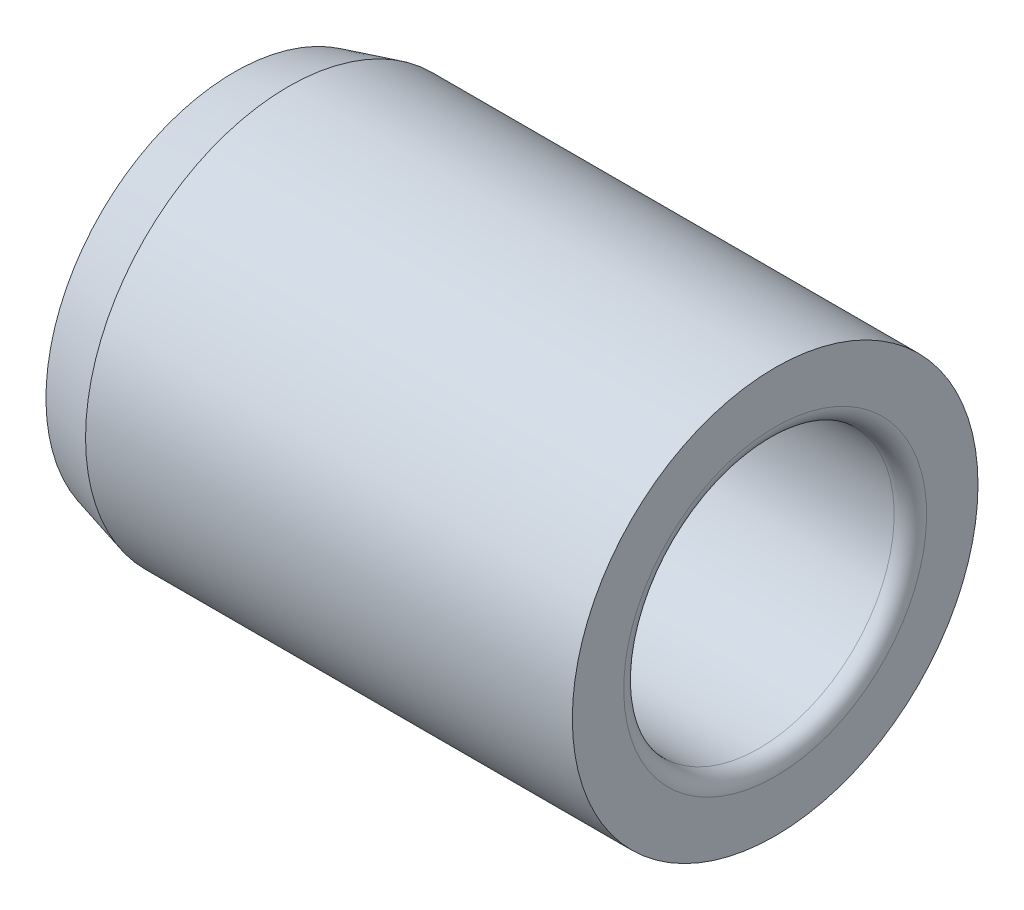
ISO-10303-21;
HEADER;
FILE_DESCRIPTION(('STEP AP214'),'2;1');
FILE_NAME('part.step','',(''),(''),'','','');
FILE_SCHEMA(('AUTOMOTIVE_DESIGN { 1 0 10303 214 1 1 1 1 }'));
ENDSEC;
DATA;
#1=APPLICATION_CONTEXT('core data for automotive mechanical design processes');
#2=APPLICATION_PROTOCOL_DEFINITION('international standard','automotive_design',2000,#1);
#3=PRODUCT_CONTEXT('',#1,'mechanical');
#4=PRODUCT('Part','Part','',(#3));
#5=PRODUCT_RELATED_PRODUCT_CATEGORY('part','',(#4));
#6=PRODUCT_DEFINITION_FORMATION('','',#4);
#7=PRODUCT_DEFINITION_CONTEXT('part definition',#1,'design');
#8=PRODUCT_DEFINITION('design','',#6,#7);
#9=PRODUCT_DEFINITION_SHAPE('','',#8);
#10=(LENGTH_UNIT() NAMED_UNIT(*) SI_UNIT(.MILLI.,.METRE.));
#11=(NAMED_UNIT(*) PLANE_ANGLE_UNIT() SI_UNIT($,.RADIAN.));
#12=(NAMED_UNIT(*) SI_UNIT($,.STERADIAN.) SOLID_ANGLE_UNIT());
#13=UNCERTAINTY_MEASURE_WITH_UNIT(LENGTH_MEASURE(1.E-05),#10,'distance_accuracy_value','');
#14=(GEOMETRIC_REPRESENTATION_CONTEXT(3) GLOBAL_UNCERTAINTY_ASSIGNED_CONTEXT((#13)) GLOBAL_UNIT_ASSIGNED_CONTEXT((#10,
#11,#12)) REPRESENTATION_CONTEXT('',''));
#15=CARTESIAN_POINT('',(0.,0.,0.));
#16=DIRECTION('',(0.,0.,1.));
#17=DIRECTION('',(1.,0.,0.));
#18=AXIS2_PLACEMENT_3D('',#15,#16,#17);
#19=CARTESIAN_POINT('',(11.938,0.,0.));
#20=DIRECTION('',(-1.,0.,0.));
#21=DIRECTION('',(0.,-1.,0.));
#22=AXIS2_PLACEMENT_3D('',#19,#20,#21);
#23=TOROIDAL_SURFACE('',#22,7.11199999999999,0.761999999999999);
#24=CARTESIAN_POINT('',(12.7,0.,0.));
#25=DIRECTION('',(-1.,0.,0.));
#26=DIRECTION('',(0.,-1.,0.));
#27=AXIS2_PLACEMENT_3D('',#24,#25,#26);
#28=CIRCLE('',#27,7.11199999999999);
#29=CARTESIAN_POINT('',(12.7,-7.11199999999999,0.));
#30=VERTEX_POINT('',#29);
#31=EDGE_CURVE('E10',#30,#30,#28,.T.);
#32=ORIENTED_EDGE('',*,*,#31,.F.);
#33=EDGE_LOOP('',(#32));
#34=FACE_BOUND('',#33,.T.);
#35=CARTESIAN_POINT('',(11.938,0.,0.));
#36=DIRECTION('',(-1.,0.,0.));
#37=DIRECTION('',(0.,-1.,0.));
#38=AXIS2_PLACEMENT_3D('',#35,#36,#37);
#39=CIRCLE('',#38,6.35);
#40=CARTESIAN_POINT('',(11.938,-6.35,0.));
#41=VERTEX_POINT('',#40);
#42=EDGE_CURVE('E55',#41,#41,#39,.T.);
#43=ORIENTED_EDGE('',*,*,#42,.T.);
#44=EDGE_LOOP('',(#43));
#45=FACE_BOUND('',#44,.T.);
#46=ADVANCED_FACE('F33',(#34,#45),#23,.T.);
#47=CARTESIAN_POINT('',(12.7,9.52499999999995,0.));
#48=DIRECTION('',(-1.,0.,0.));
#49=DIRECTION('',(0.,-1.,0.));
#50=AXIS2_PLACEMENT_3D('',#47,#48,#49);
#51=PLANE('',#50);
#52=CARTESIAN_POINT('',(12.7,0.,0.));
#53=DIRECTION('',(-1.,0.,0.));
#54=DIRECTION('',(0.,-1.,0.));
#55=AXIS2_PLACEMENT_3D('',#52,#53,#54);
#56=CIRCLE('',#55,9.525);
#57=CARTESIAN_POINT('',(12.7,-9.525,0.));
#58=VERTEX_POINT('',#57);
#59=EDGE_CURVE('E39',#58,#58,#56,.T.);
#60=ORIENTED_EDGE('',*,*,#59,.F.);
#61=EDGE_LOOP('',(#60));
#62=FACE_BOUND('',#61,.T.);
#63=ORIENTED_EDGE('',*,*,#31,.T.);
#64=EDGE_LOOP('',(#63));
#65=FACE_BOUND('',#64,.T.);
#66=ADVANCED_FACE('F80',(#62,#65),#51,.F.);
#67=CARTESIAN_POINT('',(-12.7,0.,0.));
#68=DIRECTION('',(-1.,0.,0.));
#69=DIRECTION('',(0.,-1.,0.));
#70=AXIS2_PLACEMENT_3D('',#67,#68,#69);
#71=CYLINDRICAL_SURFACE('',#70,9.525);
#72=CARTESIAN_POINT('',(-10.16,0.,0.));
#73=DIRECTION('',(-1.,0.,0.));
#74=DIRECTION('',(0.,-1.,0.));
#75=AXIS2_PLACEMENT_3D('',#72,#73,#74);
#76=CIRCLE('',#75,9.525);
#77=CARTESIAN_POINT('',(-10.16,-9.525,0.));
#78=VERTEX_POINT('',#77);
#79=EDGE_CURVE('E43',#78,#78,#76,.T.);
#80=ORIENTED_EDGE('',*,*,#79,.F.);
#81=EDGE_LOOP('',(#80));
#82=FACE_BOUND('',#81,.T.);
#83=ORIENTED_EDGE('',*,*,#59,.T.);
#84=EDGE_LOOP('',(#83));
#85=FACE_BOUND('',#84,.T.);
#86=ADVANCED_FACE('F75',(#82,#85),#71,.T.);
#87=CARTESIAN_POINT('',(-10.16,0.,0.));
#88=DIRECTION('',(1.,0.,0.));
#89=DIRECTION('',(0.,1.,0.));
#90=AXIS2_PLACEMENT_3D('',#87,#88,#89);
#91=CONICAL_SURFACE('',#90,9.525,0.26179938779915);
#92=CARTESIAN_POINT('',(-12.7,0.,0.));
#93=DIRECTION('',(-1.,0.,0.));
#94=DIRECTION('',(0.,-1.,0.));
#95=AXIS2_PLACEMENT_3D('',#92,#93,#94);
#96=CIRCLE('',#95,8.84440905122495);
#97=CARTESIAN_POINT('',(-12.7,-8.84440905122498,0.));
#98=VERTEX_POINT('',#97);
#99=EDGE_CURVE('E47',#98,#98,#96,.T.);
#100=ORIENTED_EDGE('',*,*,#99,.F.);
#101=EDGE_LOOP('',(#100));
#102=FACE_BOUND('',#101,.T.);
#103=ORIENTED_EDGE('',*,*,#79,.T.);
#104=EDGE_LOOP('',(#103));
#105=FACE_BOUND('',#104,.T.);
#106=ADVANCED_FACE('F69',(#102,#105),#91,.T.);
#107=CARTESIAN_POINT('',(-12.7,8.84440905122494,0.));
#108=DIRECTION('',(1.,0.,0.));
#109=DIRECTION('',(0.,1.,0.));
#110=AXIS2_PLACEMENT_3D('',#107,#108,#109);
#111=PLANE('',#110);
#112=CARTESIAN_POINT('',(-12.7,0.,0.));
#113=DIRECTION('',(-1.,0.,0.));
#114=DIRECTION('',(0.,-1.,0.));
#115=AXIS2_PLACEMENT_3D('',#112,#113,#114);
#116=CIRCLE('',#115,6.35);
#117=CARTESIAN_POINT('',(-12.7,-6.35000000000003,0.));
#118=VERTEX_POINT('',#117);
#119=EDGE_CURVE('E52',#118,#118,#116,.T.);
#120=ORIENTED_EDGE('',*,*,#119,.F.);
#121=EDGE_LOOP('',(#120));
#122=FACE_BOUND('',#121,.T.);
#123=ORIENTED_EDGE('',*,*,#99,.T.);
#124=EDGE_LOOP('',(#123));
#125=FACE_BOUND('',#124,.T.);
#126=ADVANCED_FACE('F63',(#122,#125),#111,.F.);
#127=CARTESIAN_POINT('',(-12.7,0.,0.));
#128=DIRECTION('',(-1.,0.,0.));
#129=DIRECTION('',(0.,-1.,0.));
#130=AXIS2_PLACEMENT_3D('',#127,#128,#129);
#131=CYLINDRICAL_SURFACE('',#130,6.35);
#132=ORIENTED_EDGE('',*,*,#42,.F.);
#133=EDGE_LOOP('',(#132));
#134=FACE_BOUND('',#133,.T.);
#135=ORIENTED_EDGE('',*,*,#119,.T.);
#136=EDGE_LOOP('',(#135));
#137=FACE_BOUND('',#136,.T.);
#138=ADVANCED_FACE('F60',(#134,#137),#131,.F.);
#139=CLOSED_SHELL('',(#46,#66,#86,#106,#126,#138));
#140=MANIFOLD_SOLID_BREP('B2',#139);
#141=ADVANCED_BREP_SHAPE_REPRESENTATION('',(#18,#140),#14);
#142=SHAPE_DEFINITION_REPRESENTATION(#9,#141);
ENDSEC;
END-ISO-10303-21;
